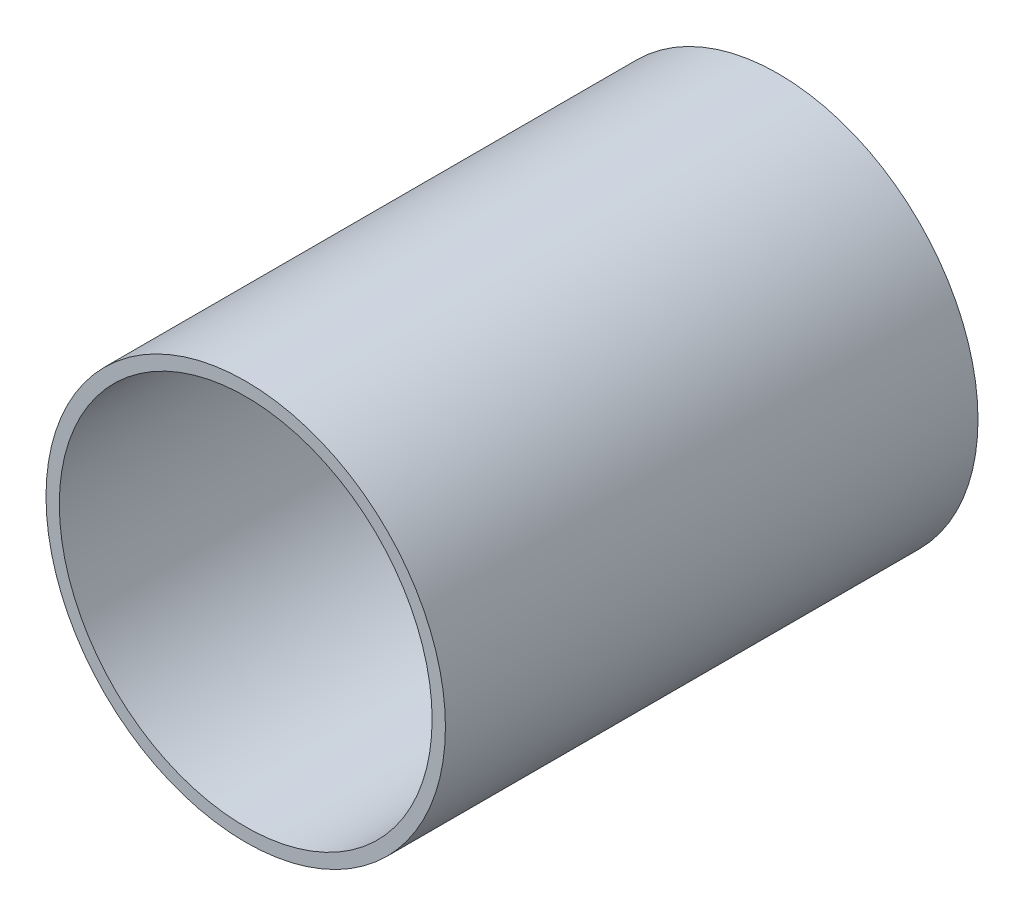
ISO-10303-21;
HEADER;
FILE_DESCRIPTION(('STEP AP214'),'2;1');
FILE_NAME('part.step','',(''),(''),'','','');
FILE_SCHEMA(('AUTOMOTIVE_DESIGN { 1 0 10303 214 1 1 1 1 }'));
ENDSEC;
DATA;
#1=APPLICATION_CONTEXT('core data for automotive mechanical design processes');
#2=APPLICATION_PROTOCOL_DEFINITION('international standard','automotive_design',2000,#1);
#3=PRODUCT_CONTEXT('',#1,'mechanical');
#4=PRODUCT('Part','Part','',(#3));
#5=PRODUCT_RELATED_PRODUCT_CATEGORY('part','',(#4));
#6=PRODUCT_DEFINITION_FORMATION('','',#4);
#7=PRODUCT_DEFINITION_CONTEXT('part definition',#1,'design');
#8=PRODUCT_DEFINITION('design','',#6,#7);
#9=PRODUCT_DEFINITION_SHAPE('','',#8);
#10=(LENGTH_UNIT() NAMED_UNIT(*) SI_UNIT(.MILLI.,.METRE.));
#11=(NAMED_UNIT(*) PLANE_ANGLE_UNIT() SI_UNIT($,.RADIAN.));
#12=(NAMED_UNIT(*) SI_UNIT($,.STERADIAN.) SOLID_ANGLE_UNIT());
#13=UNCERTAINTY_MEASURE_WITH_UNIT(LENGTH_MEASURE(1.E-05),#10,'distance_accuracy_value','');
#14=(GEOMETRIC_REPRESENTATION_CONTEXT(3) GLOBAL_UNCERTAINTY_ASSIGNED_CONTEXT((#13)) GLOBAL_UNIT_ASSIGNED_CONTEXT((#10,
#11,#12)) REPRESENTATION_CONTEXT('',''));
#15=CARTESIAN_POINT('',(0.,0.,0.));
#16=DIRECTION('',(0.,0.,1.));
#17=DIRECTION('',(1.,0.,0.));
#18=AXIS2_PLACEMENT_3D('',#15,#16,#17);
#19=CARTESIAN_POINT('',(0.,0.,200.));
#20=DIRECTION('',(0.,0.,-1.));
#21=DIRECTION('',(-1.,0.,0.));
#22=AXIS2_PLACEMENT_3D('',#19,#20,#21);
#23=CYLINDRICAL_SURFACE('',#22,70.);
#24=CARTESIAN_POINT('',(0.,0.,200.));
#25=DIRECTION('',(0.,0.,1.));
#26=DIRECTION('',(1.,0.,0.));
#27=AXIS2_PLACEMENT_3D('',#24,#25,#26);
#28=CIRCLE('',#27,70.);
#29=CARTESIAN_POINT('',(70.,0.,200.));
#30=VERTEX_POINT('',#29);
#31=EDGE_CURVE('E42',#30,#30,#28,.T.);
#32=ORIENTED_EDGE('',*,*,#31,.T.);
#33=EDGE_LOOP('',(#32));
#34=FACE_BOUND('',#33,.T.);
#35=CARTESIAN_POINT('',(0.,0.,5.));
#36=DIRECTION('',(0.,0.,-1.));
#37=DIRECTION('',(-1.,0.,0.));
#38=AXIS2_PLACEMENT_3D('',#35,#36,#37);
#39=CIRCLE('',#38,70.);
#40=CARTESIAN_POINT('',(-70.,0.,5.));
#41=VERTEX_POINT('',#40);
#42=EDGE_CURVE('E46',#41,#41,#39,.T.);
#43=ORIENTED_EDGE('',*,*,#42,.T.);
#44=EDGE_LOOP('',(#43));
#45=FACE_BOUND('',#44,.T.);
#46=ADVANCED_FACE('F31',(#34,#45),#23,.F.);
#47=CARTESIAN_POINT('',(0.,0.,200.));
#48=DIRECTION('',(0.,0.,1.));
#49=DIRECTION('',(1.,0.,0.));
#50=AXIS2_PLACEMENT_3D('',#47,#48,#49);
#51=PLANE('',#50);
#52=CARTESIAN_POINT('',(0.,0.,200.));
#53=DIRECTION('',(0.,0.,1.));
#54=DIRECTION('',(1.,0.,0.));
#55=AXIS2_PLACEMENT_3D('',#52,#53,#54);
#56=CIRCLE('',#55,75.);
#57=CARTESIAN_POINT('',(75.,0.,200.));
#58=VERTEX_POINT('',#57);
#59=EDGE_CURVE('E10',#58,#58,#56,.T.);
#60=ORIENTED_EDGE('',*,*,#59,.T.);
#61=EDGE_LOOP('',(#60));
#62=FACE_BOUND('',#61,.T.);
#63=ORIENTED_EDGE('',*,*,#31,.F.);
#64=EDGE_LOOP('',(#63));
#65=FACE_BOUND('',#64,.T.);
#66=ADVANCED_FACE('F61',(#62,#65),#51,.T.);
#67=CARTESIAN_POINT('',(0.,0.,0.));
#68=DIRECTION('',(0.,0.,1.));
#69=DIRECTION('',(1.,0.,0.));
#70=AXIS2_PLACEMENT_3D('',#67,#68,#69);
#71=PLANE('',#70);
#72=CARTESIAN_POINT('',(0.,0.,0.));
#73=DIRECTION('',(0.,0.,1.));
#74=DIRECTION('',(1.,0.,0.));
#75=AXIS2_PLACEMENT_3D('',#72,#73,#74);
#76=CIRCLE('',#75,75.);
#77=CARTESIAN_POINT('',(75.,0.,0.));
#78=VERTEX_POINT('',#77);
#79=EDGE_CURVE('E35',#78,#78,#76,.T.);
#80=ORIENTED_EDGE('',*,*,#79,.F.);
#81=EDGE_LOOP('',(#80));
#82=FACE_BOUND('',#81,.T.);
#83=ADVANCED_FACE('F57',(#82),#71,.F.);
#84=CARTESIAN_POINT('',(0.,0.,200.));
#85=DIRECTION('',(0.,0.,-1.));
#86=DIRECTION('',(-1.,0.,0.));
#87=AXIS2_PLACEMENT_3D('',#84,#85,#86);
#88=CYLINDRICAL_SURFACE('',#87,75.);
#89=ORIENTED_EDGE('',*,*,#59,.F.);
#90=EDGE_LOOP('',(#89));
#91=FACE_BOUND('',#90,.T.);
#92=ORIENTED_EDGE('',*,*,#79,.T.);
#93=EDGE_LOOP('',(#92));
#94=FACE_BOUND('',#93,.T.);
#95=ADVANCED_FACE('F33',(#91,#94),#88,.T.);
#96=CARTESIAN_POINT('',(0.,0.,5.));
#97=DIRECTION('',(0.,0.,-1.));
#98=DIRECTION('',(-1.,0.,0.));
#99=AXIS2_PLACEMENT_3D('',#96,#97,#98);
#100=PLANE('',#99);
#101=ORIENTED_EDGE('',*,*,#42,.F.);
#102=EDGE_LOOP('',(#101));
#103=FACE_BOUND('',#102,.T.);
#104=ADVANCED_FACE('F51',(#103),#100,.F.);
#105=CLOSED_SHELL('',(#46,#66,#83,#95,#104));
#106=MANIFOLD_SOLID_BREP('B2',#105);
#107=ADVANCED_BREP_SHAPE_REPRESENTATION('',(#18,#106),#14);
#108=SHAPE_DEFINITION_REPRESENTATION(#9,#107);
ENDSEC;
END-ISO-10303-21;
